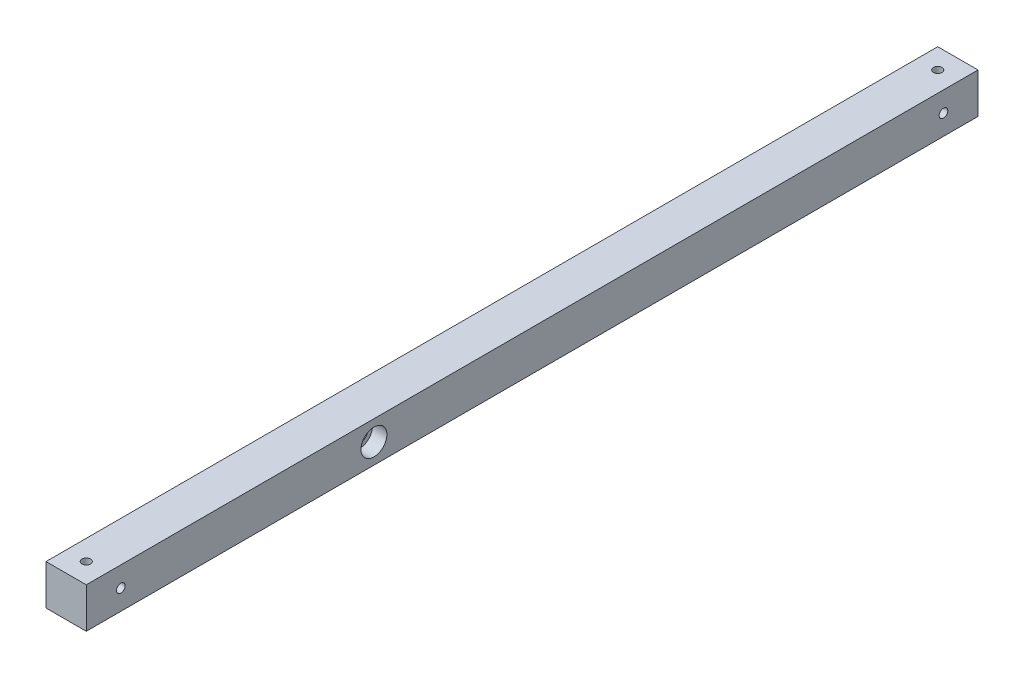
ISO-10303-21;
HEADER;
FILE_DESCRIPTION(('STEP AP214'),'2;1');
FILE_NAME('part.step','',(''),(''),'','','');
FILE_SCHEMA(('AUTOMOTIVE_DESIGN { 1 0 10303 214 1 1 1 1 }'));
ENDSEC;
DATA;
#1=APPLICATION_CONTEXT('core data for automotive mechanical design processes');
#2=APPLICATION_PROTOCOL_DEFINITION('international standard','automotive_design',2000,#1);
#3=PRODUCT_CONTEXT('',#1,'mechanical');
#4=PRODUCT('Part','Part','',(#3));
#5=PRODUCT_RELATED_PRODUCT_CATEGORY('part','',(#4));
#6=PRODUCT_DEFINITION_FORMATION('','',#4);
#7=PRODUCT_DEFINITION_CONTEXT('part definition',#1,'design');
#8=PRODUCT_DEFINITION('design','',#6,#7);
#9=PRODUCT_DEFINITION_SHAPE('','',#8);
#10=(LENGTH_UNIT() NAMED_UNIT(*) SI_UNIT(.MILLI.,.METRE.));
#11=(NAMED_UNIT(*) PLANE_ANGLE_UNIT() SI_UNIT($,.RADIAN.));
#12=(NAMED_UNIT(*) SI_UNIT($,.STERADIAN.) SOLID_ANGLE_UNIT());
#13=UNCERTAINTY_MEASURE_WITH_UNIT(LENGTH_MEASURE(1.E-05),#10,'distance_accuracy_value','');
#14=(GEOMETRIC_REPRESENTATION_CONTEXT(3) GLOBAL_UNCERTAINTY_ASSIGNED_CONTEXT((#13)) GLOBAL_UNIT_ASSIGNED_CONTEXT((#10,
#11,#12)) REPRESENTATION_CONTEXT('',''));
#15=CARTESIAN_POINT('',(0.,0.,0.));
#16=DIRECTION('',(0.,0.,1.));
#17=DIRECTION('',(1.,0.,0.));
#18=AXIS2_PLACEMENT_3D('',#15,#16,#17);
#19=CARTESIAN_POINT('',(14.,0.,596.));
#20=DIRECTION('',(-1.,0.,0.));
#21=DIRECTION('',(0.,0.,1.));
#22=AXIS2_PLACEMENT_3D('',#19,#20,#21);
#23=CYLINDRICAL_SURFACE('',#22,3.00000000000005);
#24=CARTESIAN_POINT('',(14.,0.,596.));
#25=DIRECTION('',(-1.,0.,0.));
#26=DIRECTION('',(0.,0.,1.));
#27=AXIS2_PLACEMENT_3D('',#24,#25,#26);
#28=CIRCLE('',#27,3.00000000000005);
#29=CARTESIAN_POINT('',(14.,0.,599.));
#30=VERTEX_POINT('',#29);
#31=EDGE_CURVE('E126',#30,#30,#28,.T.);
#32=ORIENTED_EDGE('',*,*,#31,.F.);
#33=EDGE_LOOP('',(#32));
#34=FACE_BOUND('',#33,.T.);
#35=CARTESIAN_POINT('',(-7.,0.,596.));
#36=DIRECTION('',(-1.,0.,0.));
#37=DIRECTION('',(0.,0.,1.));
#38=AXIS2_PLACEMENT_3D('',#35,#36,#37);
#39=CIRCLE('',#38,3.00000000000005);
#40=CARTESIAN_POINT('',(-7.,0.,599.));
#41=VERTEX_POINT('',#40);
#42=EDGE_CURVE('E36',#41,#41,#39,.F.);
#43=ORIENTED_EDGE('',*,*,#42,.F.);
#44=EDGE_LOOP('',(#43));
#45=FACE_BOUND('',#44,.T.);
#46=ADVANCED_FACE('F32',(#34,#45),#23,.F.);
#47=CARTESIAN_POINT('',(14.,0.,24.));
#48=DIRECTION('',(-1.,0.,0.));
#49=DIRECTION('',(0.,0.,1.));
#50=AXIS2_PLACEMENT_3D('',#47,#48,#49);
#51=CYLINDRICAL_SURFACE('',#50,3.);
#52=CARTESIAN_POINT('',(14.,0.,24.));
#53=DIRECTION('',(-1.,0.,0.));
#54=DIRECTION('',(0.,0.,1.));
#55=AXIS2_PLACEMENT_3D('',#52,#53,#54);
#56=CIRCLE('',#55,3.);
#57=CARTESIAN_POINT('',(14.,0.,27.));
#58=VERTEX_POINT('',#57);
#59=EDGE_CURVE('E141',#58,#58,#56,.T.);
#60=ORIENTED_EDGE('',*,*,#59,.F.);
#61=EDGE_LOOP('',(#60));
#62=FACE_BOUND('',#61,.T.);
#63=CARTESIAN_POINT('',(-7.,0.,24.));
#64=DIRECTION('',(-1.,0.,0.));
#65=DIRECTION('',(0.,0.,1.));
#66=AXIS2_PLACEMENT_3D('',#63,#64,#65);
#67=CIRCLE('',#66,3.);
#68=CARTESIAN_POINT('',(-7.,0.,27.));
#69=VERTEX_POINT('',#68);
#70=EDGE_CURVE('E120',#69,#69,#67,.F.);
#71=ORIENTED_EDGE('',*,*,#70,.F.);
#72=EDGE_LOOP('',(#71));
#73=FACE_BOUND('',#72,.T.);
#74=ADVANCED_FACE('F195',(#62,#73),#51,.F.);
#75=CARTESIAN_POINT('',(-14.,0.,420.));
#76=DIRECTION('',(1.,0.,0.));
#77=DIRECTION('',(0.,0.,-1.));
#78=AXIS2_PLACEMENT_3D('',#75,#76,#77);
#79=CYLINDRICAL_SURFACE('',#78,5.99999999999999);
#80=CARTESIAN_POINT('',(-14.,0.,420.));
#81=DIRECTION('',(1.,0.,0.));
#82=DIRECTION('',(0.,0.,-1.));
#83=AXIS2_PLACEMENT_3D('',#80,#81,#82);
#84=CIRCLE('',#83,5.99999999999999);
#85=CARTESIAN_POINT('',(-14.,0.,414.));
#86=VERTEX_POINT('',#85);
#87=EDGE_CURVE('E118',#86,#86,#84,.T.);
#88=ORIENTED_EDGE('',*,*,#87,.F.);
#89=EDGE_LOOP('',(#88));
#90=FACE_BOUND('',#89,.T.);
#91=CARTESIAN_POINT('',(4.,0.,420.));
#92=DIRECTION('',(1.,0.,0.));
#93=DIRECTION('',(0.,0.,-1.));
#94=AXIS2_PLACEMENT_3D('',#91,#92,#93);
#95=CIRCLE('',#94,5.99999999999999);
#96=CARTESIAN_POINT('',(4.,0.,414.));
#97=VERTEX_POINT('',#96);
#98=EDGE_CURVE('E116',#97,#97,#95,.F.);
#99=ORIENTED_EDGE('',*,*,#98,.F.);
#100=EDGE_LOOP('',(#99));
#101=FACE_BOUND('',#100,.T.);
#102=ADVANCED_FACE('F174',(#90,#101),#79,.F.);
#103=CARTESIAN_POINT('',(0.,14.,606.));
#104=DIRECTION('',(0.,-1.,0.));
#105=DIRECTION('',(0.,0.,-1.));
#106=AXIS2_PLACEMENT_3D('',#103,#104,#105);
#107=CYLINDRICAL_SURFACE('',#106,3.);
#108=CARTESIAN_POINT('',(0.,14.,606.));
#109=DIRECTION('',(0.,-1.,0.));
#110=DIRECTION('',(0.,0.,-1.));
#111=AXIS2_PLACEMENT_3D('',#108,#109,#110);
#112=CIRCLE('',#111,3.);
#113=CARTESIAN_POINT('',(0.,14.,603.));
#114=VERTEX_POINT('',#113);
#115=EDGE_CURVE('E115',#114,#114,#112,.T.);
#116=ORIENTED_EDGE('',*,*,#115,.F.);
#117=EDGE_LOOP('',(#116));
#118=FACE_BOUND('',#117,.T.);
#119=CARTESIAN_POINT('',(0.,-7.,606.));
#120=DIRECTION('',(0.,-1.,0.));
#121=DIRECTION('',(0.,0.,-1.));
#122=AXIS2_PLACEMENT_3D('',#119,#120,#121);
#123=CIRCLE('',#122,3.);
#124=CARTESIAN_POINT('',(0.,-7.,603.));
#125=VERTEX_POINT('',#124);
#126=EDGE_CURVE('E111',#125,#125,#123,.F.);
#127=ORIENTED_EDGE('',*,*,#126,.F.);
#128=EDGE_LOOP('',(#127));
#129=FACE_BOUND('',#128,.T.);
#130=ADVANCED_FACE('F170',(#118,#129),#107,.F.);
#131=CARTESIAN_POINT('',(0.,14.,14.));
#132=DIRECTION('',(0.,-1.,0.));
#133=DIRECTION('',(0.,0.,-1.));
#134=AXIS2_PLACEMENT_3D('',#131,#132,#133);
#135=CYLINDRICAL_SURFACE('',#134,3.);
#136=CARTESIAN_POINT('',(0.,14.,14.));
#137=DIRECTION('',(0.,-1.,0.));
#138=DIRECTION('',(0.,0.,-1.));
#139=AXIS2_PLACEMENT_3D('',#136,#137,#138);
#140=CIRCLE('',#139,3.);
#141=CARTESIAN_POINT('',(0.,14.,11.));
#142=VERTEX_POINT('',#141);
#143=EDGE_CURVE('E102',#142,#142,#140,.T.);
#144=ORIENTED_EDGE('',*,*,#143,.F.);
#145=EDGE_LOOP('',(#144));
#146=FACE_BOUND('',#145,.T.);
#147=CARTESIAN_POINT('',(0.,-7.,14.));
#148=DIRECTION('',(0.,-1.,0.));
#149=DIRECTION('',(0.,0.,-1.));
#150=AXIS2_PLACEMENT_3D('',#147,#148,#149);
#151=CIRCLE('',#150,3.);
#152=CARTESIAN_POINT('',(0.,-7.,11.));
#153=VERTEX_POINT('',#152);
#154=EDGE_CURVE('E108',#153,#153,#151,.F.);
#155=ORIENTED_EDGE('',*,*,#154,.F.);
#156=EDGE_LOOP('',(#155));
#157=FACE_BOUND('',#156,.T.);
#158=ADVANCED_FACE('F173',(#146,#157),#135,.F.);
#159=CARTESIAN_POINT('',(14.,-14.,620.));
#160=DIRECTION('',(-1.,0.,0.));
#161=DIRECTION('',(0.,0.,1.));
#162=AXIS2_PLACEMENT_3D('',#159,#160,#161);
#163=PLANE('',#162);
#164=ORIENTED_EDGE('',*,*,#59,.T.);
#165=EDGE_LOOP('',(#164));
#166=FACE_BOUND('',#165,.T.);
#167=ORIENTED_EDGE('',*,*,#31,.T.);
#168=EDGE_LOOP('',(#167));
#169=FACE_BOUND('',#168,.T.);
#170=CARTESIAN_POINT('',(14.,0.,420.));
#171=DIRECTION('',(1.,0.,0.));
#172=DIRECTION('',(0.,0.,-1.));
#173=AXIS2_PLACEMENT_3D('',#170,#171,#172);
#174=CIRCLE('',#173,8.99999999999998);
#175=CARTESIAN_POINT('',(14.,0.,411.));
#176=VERTEX_POINT('',#175);
#177=EDGE_CURVE('E144',#176,#176,#174,.T.);
#178=ORIENTED_EDGE('',*,*,#177,.F.);
#179=EDGE_LOOP('',(#178));
#180=FACE_BOUND('',#179,.T.);
#181=DIRECTION('',(0.,1.,0.));
#182=VECTOR('',#181,1.);
#183=CARTESIAN_POINT('',(14.,-14.,0.));
#184=LINE('',#183,#182);
#185=CARTESIAN_POINT('',(14.,-14.,0.));
#186=VERTEX_POINT('',#185);
#187=CARTESIAN_POINT('',(14.,14.,0.));
#188=VERTEX_POINT('',#187);
#189=EDGE_CURVE('E99',#186,#188,#184,.T.);
#190=ORIENTED_EDGE('',*,*,#189,.T.);
#191=DIRECTION('',(0.,0.,-1.));
#192=VECTOR('',#191,1.);
#193=CARTESIAN_POINT('',(14.,14.,620.));
#194=LINE('',#193,#192);
#195=CARTESIAN_POINT('',(14.,14.,620.));
#196=VERTEX_POINT('',#195);
#197=EDGE_CURVE('E11',#196,#188,#194,.T.);
#198=ORIENTED_EDGE('',*,*,#197,.F.);
#199=DIRECTION('',(0.,1.,0.));
#200=VECTOR('',#199,1.);
#201=CARTESIAN_POINT('',(14.,-14.,620.));
#202=LINE('',#201,#200);
#203=CARTESIAN_POINT('',(14.,-14.,620.));
#204=VERTEX_POINT('',#203);
#205=EDGE_CURVE('E86',#204,#196,#202,.T.);
#206=ORIENTED_EDGE('',*,*,#205,.F.);
#207=DIRECTION('',(0.,0.,-1.));
#208=VECTOR('',#207,1.);
#209=CARTESIAN_POINT('',(14.,-14.,620.));
#210=LINE('',#209,#208);
#211=EDGE_CURVE('E95',#204,#186,#210,.T.);
#212=ORIENTED_EDGE('',*,*,#211,.T.);
#213=EDGE_LOOP('',(#190,#198,#206,#212));
#214=FACE_BOUND('',#213,.T.);
#215=ADVANCED_FACE('F34',(#166,#169,#180,#214),#163,.F.);
#216=CARTESIAN_POINT('',(-14.,14.,620.));
#217=DIRECTION('',(0.,-1.,0.));
#218=DIRECTION('',(0.,0.,-1.));
#219=AXIS2_PLACEMENT_3D('',#216,#217,#218);
#220=PLANE('',#219);
#221=ORIENTED_EDGE('',*,*,#143,.T.);
#222=EDGE_LOOP('',(#221));
#223=FACE_BOUND('',#222,.T.);
#224=ORIENTED_EDGE('',*,*,#115,.T.);
#225=EDGE_LOOP('',(#224));
#226=FACE_BOUND('',#225,.T.);
#227=DIRECTION('',(-1.,0.,0.));
#228=VECTOR('',#227,1.);
#229=CARTESIAN_POINT('',(-14.,14.,0.));
#230=LINE('',#229,#228);
#231=CARTESIAN_POINT('',(-14.,14.,0.));
#232=VERTEX_POINT('',#231);
#233=EDGE_CURVE('E90',#188,#232,#230,.T.);
#234=ORIENTED_EDGE('',*,*,#233,.T.);
#235=DIRECTION('',(0.,0.,-1.));
#236=VECTOR('',#235,1.);
#237=CARTESIAN_POINT('',(-14.,14.,620.));
#238=LINE('',#237,#236);
#239=CARTESIAN_POINT('',(-14.,14.,620.));
#240=VERTEX_POINT('',#239);
#241=EDGE_CURVE('E42',#240,#232,#238,.T.);
#242=ORIENTED_EDGE('',*,*,#241,.F.);
#243=DIRECTION('',(-1.,0.,0.));
#244=VECTOR('',#243,1.);
#245=CARTESIAN_POINT('',(-14.,14.,620.));
#246=LINE('',#245,#244);
#247=EDGE_CURVE('E81',#196,#240,#246,.T.);
#248=ORIENTED_EDGE('',*,*,#247,.F.);
#249=ORIENTED_EDGE('',*,*,#197,.T.);
#250=EDGE_LOOP('',(#234,#242,#248,#249));
#251=FACE_BOUND('',#250,.T.);
#252=ADVANCED_FACE('F89',(#223,#226,#251),#220,.F.);
#253=CARTESIAN_POINT('',(-14.,-14.,620.));
#254=DIRECTION('',(1.,0.,0.));
#255=DIRECTION('',(0.,0.,-1.));
#256=AXIS2_PLACEMENT_3D('',#253,#254,#255);
#257=PLANE('',#256);
#258=CARTESIAN_POINT('',(-14.,0.,24.));
#259=DIRECTION('',(-1.,0.,0.));
#260=DIRECTION('',(0.,0.,1.));
#261=AXIS2_PLACEMENT_3D('',#258,#259,#260);
#262=CIRCLE('',#261,5.);
#263=CARTESIAN_POINT('',(-14.,0.,29.));
#264=VERTEX_POINT('',#263);
#265=EDGE_CURVE('E128',#264,#264,#262,.T.);
#266=ORIENTED_EDGE('',*,*,#265,.F.);
#267=EDGE_LOOP('',(#266));
#268=FACE_BOUND('',#267,.T.);
#269=CARTESIAN_POINT('',(-14.,0.,596.));
#270=DIRECTION('',(-1.,0.,0.));
#271=DIRECTION('',(0.,0.,1.));
#272=AXIS2_PLACEMENT_3D('',#269,#270,#271);
#273=CIRCLE('',#272,5.00000000000004);
#274=CARTESIAN_POINT('',(-14.,0.,601.));
#275=VERTEX_POINT('',#274);
#276=EDGE_CURVE('E138',#275,#275,#273,.T.);
#277=ORIENTED_EDGE('',*,*,#276,.F.);
#278=EDGE_LOOP('',(#277));
#279=FACE_BOUND('',#278,.T.);
#280=ORIENTED_EDGE('',*,*,#87,.T.);
#281=EDGE_LOOP('',(#280));
#282=FACE_BOUND('',#281,.T.);
#283=DIRECTION('',(0.,-1.,0.));
#284=VECTOR('',#283,1.);
#285=CARTESIAN_POINT('',(-14.,-14.,0.));
#286=LINE('',#285,#284);
#287=CARTESIAN_POINT('',(-14.,-14.,0.));
#288=VERTEX_POINT('',#287);
#289=EDGE_CURVE('E68',#232,#288,#286,.T.);
#290=ORIENTED_EDGE('',*,*,#289,.T.);
#291=DIRECTION('',(0.,0.,-1.));
#292=VECTOR('',#291,1.);
#293=CARTESIAN_POINT('',(-14.,-14.,620.));
#294=LINE('',#293,#292);
#295=CARTESIAN_POINT('',(-14.,-14.,620.));
#296=VERTEX_POINT('',#295);
#297=EDGE_CURVE('E91',#296,#288,#294,.T.);
#298=ORIENTED_EDGE('',*,*,#297,.F.);
#299=DIRECTION('',(0.,-1.,0.));
#300=VECTOR('',#299,1.);
#301=CARTESIAN_POINT('',(-14.,-14.,620.));
#302=LINE('',#301,#300);
#303=EDGE_CURVE('E84',#240,#296,#302,.T.);
#304=ORIENTED_EDGE('',*,*,#303,.F.);
#305=ORIENTED_EDGE('',*,*,#241,.T.);
#306=EDGE_LOOP('',(#290,#298,#304,#305));
#307=FACE_BOUND('',#306,.T.);
#308=ADVANCED_FACE('F93',(#268,#279,#282,#307),#257,.F.);
#309=CARTESIAN_POINT('',(-14.,-14.,620.));
#310=DIRECTION('',(0.,1.,0.));
#311=DIRECTION('',(0.,0.,1.));
#312=AXIS2_PLACEMENT_3D('',#309,#310,#311);
#313=PLANE('',#312);
#314=CARTESIAN_POINT('',(0.,-14.,14.));
#315=DIRECTION('',(0.,-1.,0.));
#316=DIRECTION('',(0.,0.,-1.));
#317=AXIS2_PLACEMENT_3D('',#314,#315,#316);
#318=CIRCLE('',#317,5.);
#319=CARTESIAN_POINT('',(0.,-14.,9.));
#320=VERTEX_POINT('',#319);
#321=EDGE_CURVE('E156',#320,#320,#318,.T.);
#322=ORIENTED_EDGE('',*,*,#321,.F.);
#323=EDGE_LOOP('',(#322));
#324=FACE_BOUND('',#323,.T.);
#325=CARTESIAN_POINT('',(0.,-14.,606.));
#326=DIRECTION('',(0.,-1.,0.));
#327=DIRECTION('',(0.,0.,-1.));
#328=AXIS2_PLACEMENT_3D('',#325,#326,#327);
#329=CIRCLE('',#328,5.);
#330=CARTESIAN_POINT('',(0.,-14.,601.));
#331=VERTEX_POINT('',#330);
#332=EDGE_CURVE('E153',#331,#331,#329,.T.);
#333=ORIENTED_EDGE('',*,*,#332,.F.);
#334=EDGE_LOOP('',(#333));
#335=FACE_BOUND('',#334,.T.);
#336=DIRECTION('',(1.,0.,0.));
#337=VECTOR('',#336,1.);
#338=CARTESIAN_POINT('',(-14.,-14.,0.));
#339=LINE('',#338,#337);
#340=EDGE_CURVE('E74',#288,#186,#339,.T.);
#341=ORIENTED_EDGE('',*,*,#340,.T.);
#342=ORIENTED_EDGE('',*,*,#211,.F.);
#343=DIRECTION('',(1.,0.,0.));
#344=VECTOR('',#343,1.);
#345=CARTESIAN_POINT('',(-14.,-14.,620.));
#346=LINE('',#345,#344);
#347=EDGE_CURVE('E51',#296,#204,#346,.T.);
#348=ORIENTED_EDGE('',*,*,#347,.F.);
#349=ORIENTED_EDGE('',*,*,#297,.T.);
#350=EDGE_LOOP('',(#341,#342,#348,#349));
#351=FACE_BOUND('',#350,.T.);
#352=ADVANCED_FACE('F241',(#324,#335,#351),#313,.F.);
#353=CARTESIAN_POINT('',(0.,0.,620.));
#354=DIRECTION('',(0.,0.,-1.));
#355=DIRECTION('',(-1.,0.,0.));
#356=AXIS2_PLACEMENT_3D('',#353,#354,#355);
#357=PLANE('',#356);
#358=ORIENTED_EDGE('',*,*,#205,.T.);
#359=ORIENTED_EDGE('',*,*,#247,.T.);
#360=ORIENTED_EDGE('',*,*,#303,.T.);
#361=ORIENTED_EDGE('',*,*,#347,.T.);
#362=EDGE_LOOP('',(#358,#359,#360,#361));
#363=FACE_BOUND('',#362,.T.);
#364=ADVANCED_FACE('F82',(#363),#357,.F.);
#365=CARTESIAN_POINT('',(0.,0.,0.));
#366=DIRECTION('',(0.,0.,-1.));
#367=DIRECTION('',(-1.,0.,0.));
#368=AXIS2_PLACEMENT_3D('',#365,#366,#367);
#369=PLANE('',#368);
#370=ORIENTED_EDGE('',*,*,#189,.F.);
#371=ORIENTED_EDGE('',*,*,#340,.F.);
#372=ORIENTED_EDGE('',*,*,#289,.F.);
#373=ORIENTED_EDGE('',*,*,#233,.F.);
#374=EDGE_LOOP('',(#370,#371,#372,#373));
#375=FACE_BOUND('',#374,.T.);
#376=ADVANCED_FACE('F219',(#375),#369,.T.);
#377=CARTESIAN_POINT('',(0.,-7.,14.));
#378=DIRECTION('',(0.,-1.,0.));
#379=DIRECTION('',(0.,0.,-1.));
#380=AXIS2_PLACEMENT_3D('',#377,#378,#379);
#381=PLANE('',#380);
#382=CARTESIAN_POINT('',(0.,-7.,14.));
#383=DIRECTION('',(0.,-1.,0.));
#384=DIRECTION('',(0.,0.,-1.));
#385=AXIS2_PLACEMENT_3D('',#382,#383,#384);
#386=CIRCLE('',#385,5.);
#387=CARTESIAN_POINT('',(0.,-7.,9.));
#388=VERTEX_POINT('',#387);
#389=EDGE_CURVE('E112',#388,#388,#386,.T.);
#390=ORIENTED_EDGE('',*,*,#389,.T.);
#391=EDGE_LOOP('',(#390));
#392=FACE_BOUND('',#391,.T.);
#393=ORIENTED_EDGE('',*,*,#154,.T.);
#394=EDGE_LOOP('',(#393));
#395=FACE_BOUND('',#394,.T.);
#396=ADVANCED_FACE('F191',(#392,#395),#381,.T.);
#397=CARTESIAN_POINT('',(0.,-7.,14.));
#398=DIRECTION('',(0.,-1.,0.));
#399=DIRECTION('',(0.,0.,-1.));
#400=AXIS2_PLACEMENT_3D('',#397,#398,#399);
#401=CYLINDRICAL_SURFACE('',#400,5.);
#402=ORIENTED_EDGE('',*,*,#389,.F.);
#403=EDGE_LOOP('',(#402));
#404=FACE_BOUND('',#403,.T.);
#405=ORIENTED_EDGE('',*,*,#321,.T.);
#406=EDGE_LOOP('',(#405));
#407=FACE_BOUND('',#406,.T.);
#408=ADVANCED_FACE('F181',(#404,#407),#401,.F.);
#409=CARTESIAN_POINT('',(0.,-7.,606.));
#410=DIRECTION('',(0.,-1.,0.));
#411=DIRECTION('',(0.,0.,-1.));
#412=AXIS2_PLACEMENT_3D('',#409,#410,#411);
#413=PLANE('',#412);
#414=CARTESIAN_POINT('',(0.,-7.,606.));
#415=DIRECTION('',(0.,-1.,0.));
#416=DIRECTION('',(0.,0.,-1.));
#417=AXIS2_PLACEMENT_3D('',#414,#415,#416);
#418=CIRCLE('',#417,5.);
#419=CARTESIAN_POINT('',(0.,-7.,601.));
#420=VERTEX_POINT('',#419);
#421=EDGE_CURVE('E159',#420,#420,#418,.T.);
#422=ORIENTED_EDGE('',*,*,#421,.T.);
#423=EDGE_LOOP('',(#422));
#424=FACE_BOUND('',#423,.T.);
#425=ORIENTED_EDGE('',*,*,#126,.T.);
#426=EDGE_LOOP('',(#425));
#427=FACE_BOUND('',#426,.T.);
#428=ADVANCED_FACE('F178',(#424,#427),#413,.T.);
#429=CARTESIAN_POINT('',(0.,-7.,606.));
#430=DIRECTION('',(0.,-1.,0.));
#431=DIRECTION('',(0.,0.,-1.));
#432=AXIS2_PLACEMENT_3D('',#429,#430,#431);
#433=CYLINDRICAL_SURFACE('',#432,5.);
#434=ORIENTED_EDGE('',*,*,#421,.F.);
#435=EDGE_LOOP('',(#434));
#436=FACE_BOUND('',#435,.T.);
#437=ORIENTED_EDGE('',*,*,#332,.T.);
#438=EDGE_LOOP('',(#437));
#439=FACE_BOUND('',#438,.T.);
#440=ADVANCED_FACE('F180',(#436,#439),#433,.F.);
#441=CARTESIAN_POINT('',(4.,0.,420.));
#442=DIRECTION('',(1.,0.,0.));
#443=DIRECTION('',(0.,0.,-1.));
#444=AXIS2_PLACEMENT_3D('',#441,#442,#443);
#445=PLANE('',#444);
#446=CARTESIAN_POINT('',(4.,0.,420.));
#447=DIRECTION('',(1.,0.,0.));
#448=DIRECTION('',(0.,0.,-1.));
#449=AXIS2_PLACEMENT_3D('',#446,#447,#448);
#450=CIRCLE('',#449,8.99999999999998);
#451=CARTESIAN_POINT('',(4.,0.,411.));
#452=VERTEX_POINT('',#451);
#453=EDGE_CURVE('E119',#452,#452,#450,.T.);
#454=ORIENTED_EDGE('',*,*,#453,.T.);
#455=EDGE_LOOP('',(#454));
#456=FACE_BOUND('',#455,.T.);
#457=ORIENTED_EDGE('',*,*,#98,.T.);
#458=EDGE_LOOP('',(#457));
#459=FACE_BOUND('',#458,.T.);
#460=ADVANCED_FACE('F188',(#456,#459),#445,.T.);
#461=CARTESIAN_POINT('',(4.,0.,420.));
#462=DIRECTION('',(1.,0.,0.));
#463=DIRECTION('',(0.,0.,-1.));
#464=AXIS2_PLACEMENT_3D('',#461,#462,#463);
#465=CYLINDRICAL_SURFACE('',#464,8.99999999999998);
#466=ORIENTED_EDGE('',*,*,#453,.F.);
#467=EDGE_LOOP('',(#466));
#468=FACE_BOUND('',#467,.T.);
#469=ORIENTED_EDGE('',*,*,#177,.T.);
#470=EDGE_LOOP('',(#469));
#471=FACE_BOUND('',#470,.T.);
#472=ADVANCED_FACE('F210',(#468,#471),#465,.F.);
#473=CARTESIAN_POINT('',(-7.,0.,24.));
#474=DIRECTION('',(-1.,0.,0.));
#475=DIRECTION('',(0.,0.,1.));
#476=AXIS2_PLACEMENT_3D('',#473,#474,#475);
#477=PLANE('',#476);
#478=CARTESIAN_POINT('',(-7.,0.,24.));
#479=DIRECTION('',(-1.,0.,0.));
#480=DIRECTION('',(0.,0.,1.));
#481=AXIS2_PLACEMENT_3D('',#478,#479,#480);
#482=CIRCLE('',#481,5.);
#483=CARTESIAN_POINT('',(-7.,0.,29.));
#484=VERTEX_POINT('',#483);
#485=EDGE_CURVE('E122',#484,#484,#482,.T.);
#486=ORIENTED_EDGE('',*,*,#485,.T.);
#487=EDGE_LOOP('',(#486));
#488=FACE_BOUND('',#487,.T.);
#489=ORIENTED_EDGE('',*,*,#70,.T.);
#490=EDGE_LOOP('',(#489));
#491=FACE_BOUND('',#490,.T.);
#492=ADVANCED_FACE('F213',(#488,#491),#477,.T.);
#493=CARTESIAN_POINT('',(-7.,0.,24.));
#494=DIRECTION('',(-1.,0.,0.));
#495=DIRECTION('',(0.,0.,1.));
#496=AXIS2_PLACEMENT_3D('',#493,#494,#495);
#497=CYLINDRICAL_SURFACE('',#496,5.);
#498=ORIENTED_EDGE('',*,*,#485,.F.);
#499=EDGE_LOOP('',(#498));
#500=FACE_BOUND('',#499,.T.);
#501=ORIENTED_EDGE('',*,*,#265,.T.);
#502=EDGE_LOOP('',(#501));
#503=FACE_BOUND('',#502,.T.);
#504=ADVANCED_FACE('F335',(#500,#503),#497,.F.);
#505=CARTESIAN_POINT('',(-7.,0.,596.));
#506=DIRECTION('',(-1.,0.,0.));
#507=DIRECTION('',(0.,0.,1.));
#508=AXIS2_PLACEMENT_3D('',#505,#506,#507);
#509=PLANE('',#508);
#510=CARTESIAN_POINT('',(-7.,0.,596.));
#511=DIRECTION('',(-1.,0.,0.));
#512=DIRECTION('',(0.,0.,1.));
#513=AXIS2_PLACEMENT_3D('',#510,#511,#512);
#514=CIRCLE('',#513,5.00000000000004);
#515=CARTESIAN_POINT('',(-7.,0.,601.));
#516=VERTEX_POINT('',#515);
#517=EDGE_CURVE('E133',#516,#516,#514,.T.);
#518=ORIENTED_EDGE('',*,*,#517,.T.);
#519=EDGE_LOOP('',(#518));
#520=FACE_BOUND('',#519,.T.);
#521=ORIENTED_EDGE('',*,*,#42,.T.);
#522=EDGE_LOOP('',(#521));
#523=FACE_BOUND('',#522,.T.);
#524=ADVANCED_FACE('F343',(#520,#523),#509,.T.);
#525=CARTESIAN_POINT('',(-7.,0.,596.));
#526=DIRECTION('',(-1.,0.,0.));
#527=DIRECTION('',(0.,0.,1.));
#528=AXIS2_PLACEMENT_3D('',#525,#526,#527);
#529=CYLINDRICAL_SURFACE('',#528,5.00000000000004);
#530=ORIENTED_EDGE('',*,*,#517,.F.);
#531=EDGE_LOOP('',(#530));
#532=FACE_BOUND('',#531,.T.);
#533=ORIENTED_EDGE('',*,*,#276,.T.);
#534=EDGE_LOOP('',(#533));
#535=FACE_BOUND('',#534,.T.);
#536=ADVANCED_FACE('F352',(#532,#535),#529,.F.);
#537=CLOSED_SHELL('',(#46,#74,#102,#130,#158,#215,#252,#308,#352,#364,#376,#396,#408,#428,#440,
#460,#472,#492,#504,#524,#536));
#538=MANIFOLD_SOLID_BREP('B2',#537);
#539=ADVANCED_BREP_SHAPE_REPRESENTATION('',(#18,#538),#14);
#540=SHAPE_DEFINITION_REPRESENTATION(#9,#539);
ENDSEC;
END-ISO-10303-21;
